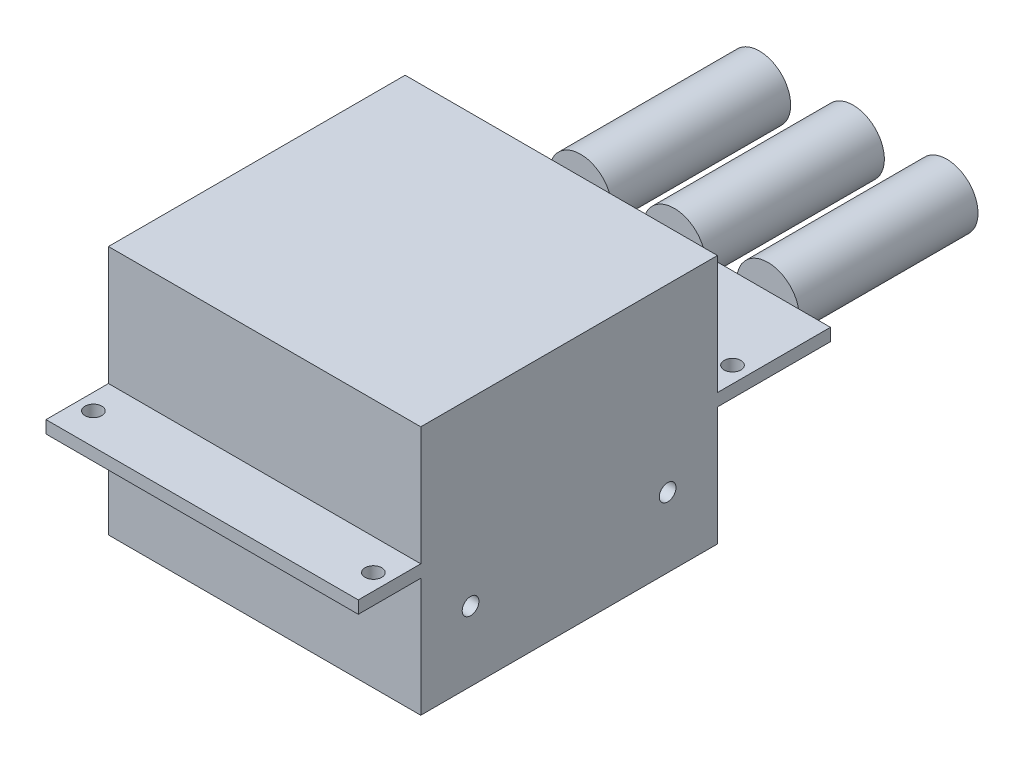
ISO-10303-21;
HEADER;
FILE_DESCRIPTION(('STEP AP214'),'2;1');
FILE_NAME('part.step','',(''),(''),'','','');
FILE_SCHEMA(('AUTOMOTIVE_DESIGN { 1 0 10303 214 1 1 1 1 }'));
ENDSEC;
DATA;
#1=APPLICATION_CONTEXT('core data for automotive mechanical design processes');
#2=APPLICATION_PROTOCOL_DEFINITION('international standard','automotive_design',2000,#1);
#3=PRODUCT_CONTEXT('',#1,'mechanical');
#4=PRODUCT('Part','Part','',(#3));
#5=PRODUCT_RELATED_PRODUCT_CATEGORY('part','',(#4));
#6=PRODUCT_DEFINITION_FORMATION('','',#4);
#7=PRODUCT_DEFINITION_CONTEXT('part definition',#1,'design');
#8=PRODUCT_DEFINITION('design','',#6,#7);
#9=PRODUCT_DEFINITION_SHAPE('','',#8);
#10=(LENGTH_UNIT() NAMED_UNIT(*) SI_UNIT(.MILLI.,.METRE.));
#11=(NAMED_UNIT(*) PLANE_ANGLE_UNIT() SI_UNIT($,.RADIAN.));
#12=(NAMED_UNIT(*) SI_UNIT($,.STERADIAN.) SOLID_ANGLE_UNIT());
#13=UNCERTAINTY_MEASURE_WITH_UNIT(LENGTH_MEASURE(1.E-05),#10,'distance_accuracy_value','');
#14=(GEOMETRIC_REPRESENTATION_CONTEXT(3) GLOBAL_UNCERTAINTY_ASSIGNED_CONTEXT((#13)) GLOBAL_UNIT_ASSIGNED_CONTEXT((#10,
#11,#12)) REPRESENTATION_CONTEXT('',''));
#15=CARTESIAN_POINT('',(0.,0.,0.));
#16=DIRECTION('',(0.,0.,1.));
#17=DIRECTION('',(1.,0.,0.));
#18=AXIS2_PLACEMENT_3D('',#15,#16,#17);
#19=CARTESIAN_POINT('',(-31.75,25.4,-96.));
#20=DIRECTION('',(-1.,0.,0.));
#21=DIRECTION('',(0.,0.,1.));
#22=AXIS2_PLACEMENT_3D('',#19,#20,#21);
#23=PLANE('',#22);
#24=CARTESIAN_POINT('',(-31.75,-11.225,-62.898125));
#25=DIRECTION('',(-1.,0.,0.));
#26=DIRECTION('',(0.,0.,1.));
#27=AXIS2_PLACEMENT_3D('',#24,#25,#26);
#28=CIRCLE('',#27,1.7);
#29=CARTESIAN_POINT('',(-31.75,-11.225,-61.198125));
#30=VERTEX_POINT('',#29);
#31=EDGE_CURVE('E332',#30,#30,#28,.T.);
#32=ORIENTED_EDGE('',*,*,#31,.F.);
#33=EDGE_LOOP('',(#32));
#34=FACE_BOUND('',#33,.T.);
#35=CARTESIAN_POINT('',(-31.75,-11.225,-22.826875));
#36=DIRECTION('',(1.,0.,0.));
#37=DIRECTION('',(0.,0.,-1.));
#38=AXIS2_PLACEMENT_3D('',#35,#36,#37);
#39=CIRCLE('',#38,1.7);
#40=CARTESIAN_POINT('',(-31.75,-11.225,-24.526875));
#41=VERTEX_POINT('',#40);
#42=EDGE_CURVE('E326',#41,#41,#39,.T.);
#43=ORIENTED_EDGE('',*,*,#42,.T.);
#44=EDGE_LOOP('',(#43));
#45=FACE_BOUND('',#44,.T.);
#46=DIRECTION('',(0.,1.,0.));
#47=VECTOR('',#46,1.);
#48=CARTESIAN_POINT('',(-31.75,25.4,-73.025));
#49=LINE('',#48,#47);
#50=CARTESIAN_POINT('',(-31.75,1.27,-73.025));
#51=VERTEX_POINT('',#50);
#52=CARTESIAN_POINT('',(-31.75,25.4,-73.025));
#53=VERTEX_POINT('',#52);
#54=EDGE_CURVE('E167',#51,#53,#49,.T.);
#55=ORIENTED_EDGE('',*,*,#54,.F.);
#56=DIRECTION('',(0.,0.,1.));
#57=VECTOR('',#56,1.);
#58=CARTESIAN_POINT('',(-31.75,1.26999999999999,-96.));
#59=LINE('',#58,#57);
#60=CARTESIAN_POINT('',(-31.75,1.26999999999999,-96.));
#61=VERTEX_POINT('',#60);
#62=EDGE_CURVE('E177',#61,#51,#59,.T.);
#63=ORIENTED_EDGE('',*,*,#62,.F.);
#64=DIRECTION('',(0.,-1.,0.));
#65=VECTOR('',#64,1.);
#66=CARTESIAN_POINT('',(-31.75,25.4,-96.));
#67=LINE('',#66,#65);
#68=CARTESIAN_POINT('',(-31.75,-1.27,-96.));
#69=VERTEX_POINT('',#68);
#70=EDGE_CURVE('E208',#61,#69,#67,.T.);
#71=ORIENTED_EDGE('',*,*,#70,.T.);
#72=DIRECTION('',(0.,0.,1.));
#73=VECTOR('',#72,1.);
#74=CARTESIAN_POINT('',(-31.75,-1.27,-96.));
#75=LINE('',#74,#73);
#76=CARTESIAN_POINT('',(-31.75,-1.27,-73.025));
#77=VERTEX_POINT('',#76);
#78=EDGE_CURVE('E271',#69,#77,#75,.T.);
#79=ORIENTED_EDGE('',*,*,#78,.T.);
#80=DIRECTION('',(0.,-1.,0.));
#81=VECTOR('',#80,1.);
#82=CARTESIAN_POINT('',(-31.75,-25.4,-73.025));
#83=LINE('',#82,#81);
#84=CARTESIAN_POINT('',(-31.75,-25.4,-73.025));
#85=VERTEX_POINT('',#84);
#86=EDGE_CURVE('E274',#77,#85,#83,.T.);
#87=ORIENTED_EDGE('',*,*,#86,.T.);
#88=DIRECTION('',(0.,0.,1.));
#89=VECTOR('',#88,1.);
#90=CARTESIAN_POINT('',(-31.75,-25.4,-96.));
#91=LINE('',#90,#89);
#92=CARTESIAN_POINT('',(-31.75,-25.4,-12.7));
#93=VERTEX_POINT('',#92);
#94=EDGE_CURVE('E42',#85,#93,#91,.T.);
#95=ORIENTED_EDGE('',*,*,#94,.T.);
#96=DIRECTION('',(0.,1.,0.));
#97=VECTOR('',#96,1.);
#98=CARTESIAN_POINT('',(-31.75,-25.4,-12.7));
#99=LINE('',#98,#97);
#100=CARTESIAN_POINT('',(-31.75,-1.27,-12.7));
#101=VERTEX_POINT('',#100);
#102=EDGE_CURVE('E244',#93,#101,#99,.T.);
#103=ORIENTED_EDGE('',*,*,#102,.T.);
#104=DIRECTION('',(0.,0.,1.));
#105=VECTOR('',#104,1.);
#106=CARTESIAN_POINT('',(-31.75,-1.27,0.));
#107=LINE('',#106,#105);
#108=CARTESIAN_POINT('',(-31.75,-1.27,0.));
#109=VERTEX_POINT('',#108);
#110=EDGE_CURVE('E247',#101,#109,#107,.T.);
#111=ORIENTED_EDGE('',*,*,#110,.T.);
#112=DIRECTION('',(0.,-1.,0.));
#113=VECTOR('',#112,1.);
#114=CARTESIAN_POINT('',(-31.75,25.4,0.));
#115=LINE('',#114,#113);
#116=CARTESIAN_POINT('',(-31.75,1.26999999999999,0.));
#117=VERTEX_POINT('',#116);
#118=EDGE_CURVE('E215',#117,#109,#115,.T.);
#119=ORIENTED_EDGE('',*,*,#118,.F.);
#120=DIRECTION('',(0.,0.,1.));
#121=VECTOR('',#120,1.);
#122=CARTESIAN_POINT('',(-31.75,1.26999999999999,0.));
#123=LINE('',#122,#121);
#124=CARTESIAN_POINT('',(-31.75,1.26999999999999,-12.7));
#125=VERTEX_POINT('',#124);
#126=EDGE_CURVE('E56',#125,#117,#123,.T.);
#127=ORIENTED_EDGE('',*,*,#126,.F.);
#128=DIRECTION('',(0.,-1.,0.));
#129=VECTOR('',#128,1.);
#130=CARTESIAN_POINT('',(-31.75,25.4,-12.7));
#131=LINE('',#130,#129);
#132=CARTESIAN_POINT('',(-31.75,25.4,-12.7));
#133=VERTEX_POINT('',#132);
#134=EDGE_CURVE('E190',#133,#125,#131,.T.);
#135=ORIENTED_EDGE('',*,*,#134,.F.);
#136=DIRECTION('',(0.,0.,1.));
#137=VECTOR('',#136,1.);
#138=CARTESIAN_POINT('',(-31.75,25.4,-96.));
#139=LINE('',#138,#137);
#140=EDGE_CURVE('E185',#53,#133,#139,.T.);
#141=ORIENTED_EDGE('',*,*,#140,.F.);
#142=EDGE_LOOP('',(#55,#63,#71,#79,#87,#95,#103,#111,#119,#127,#135,#141));
#143=FACE_BOUND('',#142,.T.);
#144=ADVANCED_FACE('F39',(#34,#45,#143),#23,.T.);
#145=CARTESIAN_POINT('',(31.75,25.4,-96.));
#146=DIRECTION('',(0.,1.,0.));
#147=DIRECTION('',(-1.,0.,0.));
#148=AXIS2_PLACEMENT_3D('',#145,#146,#147);
#149=PLANE('',#148);
#150=DIRECTION('',(0.,0.,1.));
#151=VECTOR('',#150,1.);
#152=CARTESIAN_POINT('',(31.75,25.4,-96.));
#153=LINE('',#152,#151);
#154=CARTESIAN_POINT('',(31.75,25.4,-73.025));
#155=VERTEX_POINT('',#154);
#156=CARTESIAN_POINT('',(31.75,25.4,-12.7));
#157=VERTEX_POINT('',#156);
#158=EDGE_CURVE('E187',#155,#157,#153,.T.);
#159=ORIENTED_EDGE('',*,*,#158,.F.);
#160=DIRECTION('',(1.,0.,0.));
#161=VECTOR('',#160,1.);
#162=CARTESIAN_POINT('',(-31.75,25.4,-73.025));
#163=LINE('',#162,#161);
#164=EDGE_CURVE('E171',#53,#155,#163,.T.);
#165=ORIENTED_EDGE('',*,*,#164,.F.);
#166=ORIENTED_EDGE('',*,*,#140,.T.);
#167=DIRECTION('',(1.,0.,0.));
#168=VECTOR('',#167,1.);
#169=CARTESIAN_POINT('',(-31.75,25.4,-12.7));
#170=LINE('',#169,#168);
#171=EDGE_CURVE('E286',#133,#157,#170,.T.);
#172=ORIENTED_EDGE('',*,*,#171,.T.);
#173=EDGE_LOOP('',(#159,#165,#166,#172));
#174=FACE_BOUND('',#173,.T.);
#175=ADVANCED_FACE('F183',(#174),#149,.T.);
#176=CARTESIAN_POINT('',(31.75,25.4,-96.));
#177=DIRECTION('',(1.,0.,0.));
#178=DIRECTION('',(0.,0.,-1.));
#179=AXIS2_PLACEMENT_3D('',#176,#177,#178);
#180=PLANE('',#179);
#181=CARTESIAN_POINT('',(31.75,-11.225,-62.898125));
#182=DIRECTION('',(-1.,0.,0.));
#183=DIRECTION('',(0.,0.,1.));
#184=AXIS2_PLACEMENT_3D('',#181,#182,#183);
#185=CIRCLE('',#184,1.7);
#186=CARTESIAN_POINT('',(31.75,-11.225,-61.198125));
#187=VERTEX_POINT('',#186);
#188=EDGE_CURVE('E335',#187,#187,#185,.T.);
#189=ORIENTED_EDGE('',*,*,#188,.T.);
#190=EDGE_LOOP('',(#189));
#191=FACE_BOUND('',#190,.T.);
#192=CARTESIAN_POINT('',(31.75,-11.225,-22.826875));
#193=DIRECTION('',(1.,0.,0.));
#194=DIRECTION('',(0.,0.,-1.));
#195=AXIS2_PLACEMENT_3D('',#192,#193,#194);
#196=CIRCLE('',#195,1.7);
#197=CARTESIAN_POINT('',(31.75,-11.225,-24.526875));
#198=VERTEX_POINT('',#197);
#199=EDGE_CURVE('E329',#198,#198,#196,.T.);
#200=ORIENTED_EDGE('',*,*,#199,.F.);
#201=EDGE_LOOP('',(#200));
#202=FACE_BOUND('',#201,.T.);
#203=DIRECTION('',(0.,1.,0.));
#204=VECTOR('',#203,1.);
#205=CARTESIAN_POINT('',(31.75,25.4,-96.));
#206=LINE('',#205,#204);
#207=CARTESIAN_POINT('',(31.75,-1.27,-96.));
#208=VERTEX_POINT('',#207);
#209=CARTESIAN_POINT('',(31.75,1.27000000000001,-96.));
#210=VERTEX_POINT('',#209);
#211=EDGE_CURVE('E203',#208,#210,#206,.T.);
#212=ORIENTED_EDGE('',*,*,#211,.T.);
#213=DIRECTION('',(0.,0.,1.));
#214=VECTOR('',#213,1.);
#215=CARTESIAN_POINT('',(31.75,1.27000000000001,-96.));
#216=LINE('',#215,#214);
#217=CARTESIAN_POINT('',(31.75,1.27000000000001,-73.025));
#218=VERTEX_POINT('',#217);
#219=EDGE_CURVE('E178',#210,#218,#216,.T.);
#220=ORIENTED_EDGE('',*,*,#219,.T.);
#221=DIRECTION('',(0.,1.,0.));
#222=VECTOR('',#221,1.);
#223=CARTESIAN_POINT('',(31.75,25.4,-73.025));
#224=LINE('',#223,#222);
#225=EDGE_CURVE('E288',#218,#155,#224,.T.);
#226=ORIENTED_EDGE('',*,*,#225,.T.);
#227=ORIENTED_EDGE('',*,*,#158,.T.);
#228=DIRECTION('',(0.,-1.,0.));
#229=VECTOR('',#228,1.);
#230=CARTESIAN_POINT('',(31.75,25.4,-12.7));
#231=LINE('',#230,#229);
#232=CARTESIAN_POINT('',(31.75,1.27000000000001,-12.7));
#233=VERTEX_POINT('',#232);
#234=EDGE_CURVE('E289',#157,#233,#231,.T.);
#235=ORIENTED_EDGE('',*,*,#234,.T.);
#236=DIRECTION('',(0.,0.,1.));
#237=VECTOR('',#236,1.);
#238=CARTESIAN_POINT('',(31.75,1.27000000000001,0.));
#239=LINE('',#238,#237);
#240=CARTESIAN_POINT('',(31.75,1.27000000000001,0.));
#241=VERTEX_POINT('',#240);
#242=EDGE_CURVE('E292',#233,#241,#239,.T.);
#243=ORIENTED_EDGE('',*,*,#242,.T.);
#244=DIRECTION('',(0.,1.,0.));
#245=VECTOR('',#244,1.);
#246=CARTESIAN_POINT('',(31.75,25.4,0.));
#247=LINE('',#246,#245);
#248=CARTESIAN_POINT('',(31.75,-1.27,0.));
#249=VERTEX_POINT('',#248);
#250=EDGE_CURVE('E195',#249,#241,#247,.T.);
#251=ORIENTED_EDGE('',*,*,#250,.F.);
#252=DIRECTION('',(0.,0.,1.));
#253=VECTOR('',#252,1.);
#254=CARTESIAN_POINT('',(31.75,-1.27,0.));
#255=LINE('',#254,#253);
#256=CARTESIAN_POINT('',(31.75,-1.27,-12.7));
#257=VERTEX_POINT('',#256);
#258=EDGE_CURVE('E246',#257,#249,#255,.T.);
#259=ORIENTED_EDGE('',*,*,#258,.F.);
#260=DIRECTION('',(0.,1.,0.));
#261=VECTOR('',#260,1.);
#262=CARTESIAN_POINT('',(31.75,-25.4,-12.7));
#263=LINE('',#262,#261);
#264=CARTESIAN_POINT('',(31.75,-25.4,-12.7));
#265=VERTEX_POINT('',#264);
#266=EDGE_CURVE('E251',#265,#257,#263,.T.);
#267=ORIENTED_EDGE('',*,*,#266,.F.);
#268=DIRECTION('',(0.,0.,1.));
#269=VECTOR('',#268,1.);
#270=CARTESIAN_POINT('',(31.75,-25.4,-96.));
#271=LINE('',#270,#269);
#272=CARTESIAN_POINT('',(31.75,-25.4,-73.025));
#273=VERTEX_POINT('',#272);
#274=EDGE_CURVE('E192',#273,#265,#271,.T.);
#275=ORIENTED_EDGE('',*,*,#274,.F.);
#276=DIRECTION('',(0.,-1.,0.));
#277=VECTOR('',#276,1.);
#278=CARTESIAN_POINT('',(31.75,-25.4,-73.025));
#279=LINE('',#278,#277);
#280=CARTESIAN_POINT('',(31.75,-1.27,-73.025));
#281=VERTEX_POINT('',#280);
#282=EDGE_CURVE('E269',#281,#273,#279,.T.);
#283=ORIENTED_EDGE('',*,*,#282,.F.);
#284=DIRECTION('',(0.,0.,1.));
#285=VECTOR('',#284,1.);
#286=CARTESIAN_POINT('',(31.75,-1.27,-96.));
#287=LINE('',#286,#285);
#288=EDGE_CURVE('E254',#208,#281,#287,.T.);
#289=ORIENTED_EDGE('',*,*,#288,.F.);
#290=EDGE_LOOP('',(#212,#220,#226,#227,#235,#243,#251,#259,#267,#275,#283,#289));
#291=FACE_BOUND('',#290,.T.);
#292=ADVANCED_FACE('F355',(#191,#202,#291),#180,.T.);
#293=CARTESIAN_POINT('',(0.,0.,-96.));
#294=DIRECTION('',(0.,0.,-1.));
#295=DIRECTION('',(-1.,0.,0.));
#296=AXIS2_PLACEMENT_3D('',#293,#294,#295);
#297=PLANE('',#296);
#298=ORIENTED_EDGE('',*,*,#70,.F.);
#299=DIRECTION('',(1.,0.,0.));
#300=VECTOR('',#299,1.);
#301=CARTESIAN_POINT('',(-31.75,1.26999999999999,-96.));
#302=LINE('',#301,#300);
#303=CARTESIAN_POINT('',(-25.2717039466693,1.26999999999999,-96.));
#304=VERTEX_POINT('',#303);
#305=EDGE_CURVE('E281',#61,#304,#302,.T.);
#306=ORIENTED_EDGE('',*,*,#305,.T.);
#307=CARTESIAN_POINT('',(-19.05,0.,-96.));
#308=DIRECTION('',(0.,0.,-1.));
#309=DIRECTION('',(-1.,0.,0.));
#310=AXIS2_PLACEMENT_3D('',#307,#308,#309);
#311=CIRCLE('',#310,6.35);
#312=CARTESIAN_POINT('',(-25.2717039466693,-1.27,-96.));
#313=VERTEX_POINT('',#312);
#314=EDGE_CURVE('E243',#313,#304,#311,.T.);
#315=ORIENTED_EDGE('',*,*,#314,.F.);
#316=DIRECTION('',(1.,0.,0.));
#317=VECTOR('',#316,1.);
#318=CARTESIAN_POINT('',(-31.75,-1.27,-96.));
#319=LINE('',#318,#317);
#320=EDGE_CURVE('E262',#69,#313,#319,.T.);
#321=ORIENTED_EDGE('',*,*,#320,.F.);
#322=EDGE_LOOP('',(#298,#306,#315,#321));
#323=FACE_BOUND('',#322,.T.);
#324=ADVANCED_FACE('F357',(#323),#297,.T.);
#325=CARTESIAN_POINT('',(-12.8282960533307,1.27,-96.));
#326=VERTEX_POINT('',#325);
#327=CARTESIAN_POINT('',(-12.8282960533307,-1.27,-96.));
#328=VERTEX_POINT('',#327);
#329=EDGE_CURVE('E239',#326,#328,#311,.T.);
#330=ORIENTED_EDGE('',*,*,#329,.F.);
#331=CARTESIAN_POINT('',(-6.22170394666927,1.27,-96.));
#332=VERTEX_POINT('',#331);
#333=EDGE_CURVE('E415',#326,#332,#302,.T.);
#334=ORIENTED_EDGE('',*,*,#333,.T.);
#335=CARTESIAN_POINT('',(0.,0.,-96.));
#336=DIRECTION('',(0.,0.,-1.));
#337=DIRECTION('',(-1.,0.,0.));
#338=AXIS2_PLACEMENT_3D('',#335,#336,#337);
#339=CIRCLE('',#338,6.35);
#340=CARTESIAN_POINT('',(-6.22170394666927,-1.27,-96.));
#341=VERTEX_POINT('',#340);
#342=EDGE_CURVE('E47',#341,#332,#339,.T.);
#343=ORIENTED_EDGE('',*,*,#342,.F.);
#344=EDGE_CURVE('E440',#328,#341,#319,.T.);
#345=ORIENTED_EDGE('',*,*,#344,.F.);
#346=EDGE_LOOP('',(#330,#334,#343,#345));
#347=FACE_BOUND('',#346,.T.);
#348=ADVANCED_FACE('F364',(#347),#297,.T.);
#349=CARTESIAN_POINT('',(6.22170394666927,1.27,-96.));
#350=VERTEX_POINT('',#349);
#351=CARTESIAN_POINT('',(6.22170394666927,-1.27,-96.));
#352=VERTEX_POINT('',#351);
#353=EDGE_CURVE('E49',#350,#352,#339,.T.);
#354=ORIENTED_EDGE('',*,*,#353,.F.);
#355=CARTESIAN_POINT('',(12.8282960533307,1.27,-96.));
#356=VERTEX_POINT('',#355);
#357=EDGE_CURVE('E406',#350,#356,#302,.T.);
#358=ORIENTED_EDGE('',*,*,#357,.T.);
#359=CARTESIAN_POINT('',(19.05,0.,-96.));
#360=DIRECTION('',(0.,0.,-1.));
#361=DIRECTION('',(-1.,0.,0.));
#362=AXIS2_PLACEMENT_3D('',#359,#360,#361);
#363=CIRCLE('',#362,6.35);
#364=CARTESIAN_POINT('',(12.8282960533307,-1.27,-96.));
#365=VERTEX_POINT('',#364);
#366=EDGE_CURVE('E228',#365,#356,#363,.T.);
#367=ORIENTED_EDGE('',*,*,#366,.F.);
#368=EDGE_CURVE('E438',#352,#365,#319,.T.);
#369=ORIENTED_EDGE('',*,*,#368,.F.);
#370=EDGE_LOOP('',(#354,#358,#367,#369));
#371=FACE_BOUND('',#370,.T.);
#372=ADVANCED_FACE('F441',(#371),#297,.T.);
#373=CARTESIAN_POINT('',(25.2717039466693,1.27000000000001,-96.));
#374=VERTEX_POINT('',#373);
#375=CARTESIAN_POINT('',(25.2717039466693,-1.27,-96.));
#376=VERTEX_POINT('',#375);
#377=EDGE_CURVE('E230',#374,#376,#363,.T.);
#378=ORIENTED_EDGE('',*,*,#377,.F.);
#379=EDGE_CURVE('E299',#374,#210,#302,.T.);
#380=ORIENTED_EDGE('',*,*,#379,.T.);
#381=ORIENTED_EDGE('',*,*,#211,.F.);
#382=EDGE_CURVE('E266',#376,#208,#319,.T.);
#383=ORIENTED_EDGE('',*,*,#382,.F.);
#384=EDGE_LOOP('',(#378,#380,#381,#383));
#385=FACE_BOUND('',#384,.T.);
#386=ADVANCED_FACE('F367',(#385),#297,.T.);
#387=CARTESIAN_POINT('',(0.,0.,0.));
#388=DIRECTION('',(0.,0.,-1.));
#389=DIRECTION('',(-1.,0.,0.));
#390=AXIS2_PLACEMENT_3D('',#387,#388,#389);
#391=PLANE('',#390);
#392=DIRECTION('',(1.,0.,0.));
#393=VECTOR('',#392,1.);
#394=CARTESIAN_POINT('',(-31.75,1.26999999999999,0.));
#395=LINE('',#394,#393);
#396=EDGE_CURVE('E282',#117,#241,#395,.T.);
#397=ORIENTED_EDGE('',*,*,#396,.F.);
#398=ORIENTED_EDGE('',*,*,#118,.T.);
#399=DIRECTION('',(1.,0.,0.));
#400=VECTOR('',#399,1.);
#401=CARTESIAN_POINT('',(-31.75,-1.27,0.));
#402=LINE('',#401,#400);
#403=EDGE_CURVE('E256',#109,#249,#402,.T.);
#404=ORIENTED_EDGE('',*,*,#403,.T.);
#405=ORIENTED_EDGE('',*,*,#250,.T.);
#406=EDGE_LOOP('',(#397,#398,#404,#405));
#407=FACE_BOUND('',#406,.T.);
#408=ADVANCED_FACE('F373',(#407),#391,.F.);
#409=CARTESIAN_POINT('',(31.75,-25.4,-96.));
#410=DIRECTION('',(0.,-1.,0.));
#411=DIRECTION('',(1.,0.,0.));
#412=AXIS2_PLACEMENT_3D('',#409,#410,#411);
#413=PLANE('',#412);
#414=DIRECTION('',(1.,0.,0.));
#415=VECTOR('',#414,1.);
#416=CARTESIAN_POINT('',(-31.75,-25.4,-73.025));
#417=LINE('',#416,#415);
#418=EDGE_CURVE('E240',#85,#273,#417,.T.);
#419=ORIENTED_EDGE('',*,*,#418,.T.);
#420=ORIENTED_EDGE('',*,*,#274,.T.);
#421=DIRECTION('',(1.,0.,0.));
#422=VECTOR('',#421,1.);
#423=CARTESIAN_POINT('',(-31.75,-25.4,-12.7));
#424=LINE('',#423,#422);
#425=EDGE_CURVE('E250',#93,#265,#424,.T.);
#426=ORIENTED_EDGE('',*,*,#425,.F.);
#427=ORIENTED_EDGE('',*,*,#94,.F.);
#428=EDGE_LOOP('',(#419,#420,#426,#427));
#429=FACE_BOUND('',#428,.T.);
#430=ADVANCED_FACE('F370',(#429),#413,.T.);
#431=CARTESIAN_POINT('',(0.,0.,-132.36));
#432=DIRECTION('',(0.,0.,1.));
#433=DIRECTION('',(1.,0.,0.));
#434=AXIS2_PLACEMENT_3D('',#431,#432,#433);
#435=CYLINDRICAL_SURFACE('',#434,6.35);
#436=CARTESIAN_POINT('',(0.,0.,-132.36));
#437=DIRECTION('',(0.,0.,-1.));
#438=DIRECTION('',(-1.,0.,0.));
#439=AXIS2_PLACEMENT_3D('',#436,#437,#438);
#440=CIRCLE('',#439,6.35);
#441=CARTESIAN_POINT('',(-6.35,0.,-132.36));
#442=VERTEX_POINT('',#441);
#443=EDGE_CURVE('E216',#442,#442,#440,.T.);
#444=ORIENTED_EDGE('',*,*,#443,.F.);
#445=EDGE_LOOP('',(#444));
#446=FACE_BOUND('',#445,.T.);
#447=EDGE_CURVE('E11',#352,#341,#339,.T.);
#448=ORIENTED_EDGE('',*,*,#447,.T.);
#449=ORIENTED_EDGE('',*,*,#342,.T.);
#450=CARTESIAN_POINT('',(0.,0.,-96.));
#451=DIRECTION('',(0.,0.,1.));
#452=DIRECTION('',(1.,0.,0.));
#453=AXIS2_PLACEMENT_3D('',#450,#451,#452);
#454=CIRCLE('',#453,6.35);
#455=EDGE_CURVE('E259',#350,#332,#454,.T.);
#456=ORIENTED_EDGE('',*,*,#455,.F.);
#457=ORIENTED_EDGE('',*,*,#353,.T.);
#458=EDGE_LOOP('',(#448,#449,#456,#457));
#459=FACE_BOUND('',#458,.T.);
#460=ADVANCED_FACE('F372',(#446,#459),#435,.T.);
#461=CARTESIAN_POINT('',(0.,0.,-132.36));
#462=DIRECTION('',(0.,0.,-1.));
#463=DIRECTION('',(-1.,0.,0.));
#464=AXIS2_PLACEMENT_3D('',#461,#462,#463);
#465=PLANE('',#464);
#466=ORIENTED_EDGE('',*,*,#443,.T.);
#467=EDGE_LOOP('',(#466));
#468=FACE_BOUND('',#467,.T.);
#469=ADVANCED_FACE('F378',(#468),#465,.T.);
#470=CARTESIAN_POINT('',(19.05,0.,-132.36));
#471=DIRECTION('',(0.,0.,1.));
#472=DIRECTION('',(1.,0.,0.));
#473=AXIS2_PLACEMENT_3D('',#470,#471,#472);
#474=CYLINDRICAL_SURFACE('',#473,6.35);
#475=CARTESIAN_POINT('',(19.05,0.,-132.36));
#476=DIRECTION('',(0.,0.,-1.));
#477=DIRECTION('',(-1.,0.,0.));
#478=AXIS2_PLACEMENT_3D('',#475,#476,#477);
#479=CIRCLE('',#478,6.35);
#480=CARTESIAN_POINT('',(12.7,0.,-132.36));
#481=VERTEX_POINT('',#480);
#482=EDGE_CURVE('E232',#481,#481,#479,.T.);
#483=ORIENTED_EDGE('',*,*,#482,.F.);
#484=EDGE_LOOP('',(#483));
#485=FACE_BOUND('',#484,.T.);
#486=EDGE_CURVE('E223',#376,#365,#363,.T.);
#487=ORIENTED_EDGE('',*,*,#486,.T.);
#488=ORIENTED_EDGE('',*,*,#366,.T.);
#489=CARTESIAN_POINT('',(19.05,0.,-96.));
#490=DIRECTION('',(0.,0.,1.));
#491=DIRECTION('',(1.,0.,0.));
#492=AXIS2_PLACEMENT_3D('',#489,#490,#491);
#493=CIRCLE('',#492,6.35);
#494=EDGE_CURVE('E279',#374,#356,#493,.T.);
#495=ORIENTED_EDGE('',*,*,#494,.F.);
#496=ORIENTED_EDGE('',*,*,#377,.T.);
#497=EDGE_LOOP('',(#487,#488,#495,#496));
#498=FACE_BOUND('',#497,.T.);
#499=ADVANCED_FACE('F490',(#485,#498),#474,.T.);
#500=CARTESIAN_POINT('',(19.05,0.,-132.36));
#501=DIRECTION('',(0.,0.,-1.));
#502=DIRECTION('',(-1.,0.,0.));
#503=AXIS2_PLACEMENT_3D('',#500,#501,#502);
#504=PLANE('',#503);
#505=ORIENTED_EDGE('',*,*,#482,.T.);
#506=EDGE_LOOP('',(#505));
#507=FACE_BOUND('',#506,.T.);
#508=ADVANCED_FACE('F485',(#507),#504,.T.);
#509=CARTESIAN_POINT('',(-19.05,0.,-132.36));
#510=DIRECTION('',(0.,0.,1.));
#511=DIRECTION('',(1.,0.,0.));
#512=AXIS2_PLACEMENT_3D('',#509,#510,#511);
#513=CYLINDRICAL_SURFACE('',#512,6.35);
#514=CARTESIAN_POINT('',(-19.05,0.,-132.36));
#515=DIRECTION('',(0.,0.,-1.));
#516=DIRECTION('',(-1.,0.,0.));
#517=AXIS2_PLACEMENT_3D('',#514,#515,#516);
#518=CIRCLE('',#517,6.35);
#519=CARTESIAN_POINT('',(-25.4,0.,-132.36));
#520=VERTEX_POINT('',#519);
#521=EDGE_CURVE('E236',#520,#520,#518,.T.);
#522=ORIENTED_EDGE('',*,*,#521,.F.);
#523=EDGE_LOOP('',(#522));
#524=FACE_BOUND('',#523,.T.);
#525=EDGE_CURVE('E234',#328,#313,#311,.T.);
#526=ORIENTED_EDGE('',*,*,#525,.T.);
#527=ORIENTED_EDGE('',*,*,#314,.T.);
#528=EDGE_CURVE('E455',#304,#326,#311,.T.);
#529=ORIENTED_EDGE('',*,*,#528,.T.);
#530=ORIENTED_EDGE('',*,*,#329,.T.);
#531=EDGE_LOOP('',(#526,#527,#529,#530));
#532=FACE_BOUND('',#531,.T.);
#533=ADVANCED_FACE('F454',(#524,#532),#513,.T.);
#534=CARTESIAN_POINT('',(-19.05,0.,-132.36));
#535=DIRECTION('',(0.,0.,-1.));
#536=DIRECTION('',(-1.,0.,0.));
#537=AXIS2_PLACEMENT_3D('',#534,#535,#536);
#538=PLANE('',#537);
#539=ORIENTED_EDGE('',*,*,#521,.T.);
#540=EDGE_LOOP('',(#539));
#541=FACE_BOUND('',#540,.T.);
#542=ADVANCED_FACE('F484',(#541),#538,.T.);
#543=CARTESIAN_POINT('',(-31.75,-25.4,-96.));
#544=DIRECTION('',(0.,0.,-1.));
#545=DIRECTION('',(-1.,0.,0.));
#546=AXIS2_PLACEMENT_3D('',#543,#544,#545);
#547=PLANE('',#546);
#548=EDGE_CURVE('E431',#341,#352,#319,.T.);
#549=ORIENTED_EDGE('',*,*,#548,.F.);
#550=ORIENTED_EDGE('',*,*,#447,.F.);
#551=EDGE_LOOP('',(#549,#550));
#552=FACE_BOUND('',#551,.T.);
#553=ADVANCED_FACE('F430',(#552),#547,.F.);
#554=EDGE_CURVE('E442',#365,#376,#319,.T.);
#555=ORIENTED_EDGE('',*,*,#554,.F.);
#556=ORIENTED_EDGE('',*,*,#486,.F.);
#557=EDGE_LOOP('',(#555,#556));
#558=FACE_BOUND('',#557,.T.);
#559=ADVANCED_FACE('F524',(#558),#547,.F.);
#560=EDGE_CURVE('E265',#313,#328,#319,.T.);
#561=ORIENTED_EDGE('',*,*,#560,.F.);
#562=ORIENTED_EDGE('',*,*,#525,.F.);
#563=EDGE_LOOP('',(#561,#562));
#564=FACE_BOUND('',#563,.T.);
#565=ADVANCED_FACE('F452',(#564),#547,.F.);
#566=CARTESIAN_POINT('',(-31.75,-25.4,-73.025));
#567=DIRECTION('',(0.,0.,1.));
#568=DIRECTION('',(1.,0.,0.));
#569=AXIS2_PLACEMENT_3D('',#566,#567,#568);
#570=PLANE('',#569);
#571=ORIENTED_EDGE('',*,*,#282,.T.);
#572=ORIENTED_EDGE('',*,*,#418,.F.);
#573=ORIENTED_EDGE('',*,*,#86,.F.);
#574=DIRECTION('',(1.,0.,0.));
#575=VECTOR('',#574,1.);
#576=CARTESIAN_POINT('',(-31.75,-1.27,-73.025));
#577=LINE('',#576,#575);
#578=EDGE_CURVE('E264',#77,#281,#577,.T.);
#579=ORIENTED_EDGE('',*,*,#578,.T.);
#580=EDGE_LOOP('',(#571,#572,#573,#579));
#581=FACE_BOUND('',#580,.T.);
#582=ADVANCED_FACE('F445',(#581),#570,.F.);
#583=CARTESIAN_POINT('',(-31.75,-1.27,-96.));
#584=DIRECTION('',(0.,1.,0.));
#585=DIRECTION('',(0.,0.,1.));
#586=AXIS2_PLACEMENT_3D('',#583,#584,#585);
#587=PLANE('',#586);
#588=CARTESIAN_POINT('',(28.4625,-1.27000000000001,-79.375));
#589=DIRECTION('',(0.,-1.,0.));
#590=DIRECTION('',(1.,0.,0.));
#591=AXIS2_PLACEMENT_3D('',#588,#589,#590);
#592=CIRCLE('',#591,1.7);
#593=CARTESIAN_POINT('',(30.1625,-1.27000000000001,-79.375));
#594=VERTEX_POINT('',#593);
#595=EDGE_CURVE('E308',#594,#594,#592,.T.);
#596=ORIENTED_EDGE('',*,*,#595,.F.);
#597=EDGE_LOOP('',(#596));
#598=FACE_BOUND('',#597,.T.);
#599=CARTESIAN_POINT('',(-28.4625,-1.27000000000001,-79.375));
#600=DIRECTION('',(0.,1.,0.));
#601=DIRECTION('',(-1.,0.,0.));
#602=AXIS2_PLACEMENT_3D('',#599,#600,#601);
#603=CIRCLE('',#602,1.7);
#604=CARTESIAN_POINT('',(-30.1625,-1.27000000000001,-79.375));
#605=VERTEX_POINT('',#604);
#606=EDGE_CURVE('E295',#605,#605,#603,.T.);
#607=ORIENTED_EDGE('',*,*,#606,.T.);
#608=EDGE_LOOP('',(#607));
#609=FACE_BOUND('',#608,.T.);
#610=ORIENTED_EDGE('',*,*,#288,.T.);
#611=ORIENTED_EDGE('',*,*,#578,.F.);
#612=ORIENTED_EDGE('',*,*,#78,.F.);
#613=ORIENTED_EDGE('',*,*,#320,.T.);
#614=ORIENTED_EDGE('',*,*,#560,.T.);
#615=ORIENTED_EDGE('',*,*,#344,.T.);
#616=ORIENTED_EDGE('',*,*,#548,.T.);
#617=ORIENTED_EDGE('',*,*,#368,.T.);
#618=ORIENTED_EDGE('',*,*,#554,.T.);
#619=ORIENTED_EDGE('',*,*,#382,.T.);
#620=EDGE_LOOP('',(#610,#611,#612,#613,#614,#615,#616,#617,#618,#619));
#621=FACE_BOUND('',#620,.T.);
#622=ADVANCED_FACE('F436',(#598,#609,#621),#587,.F.);
#623=CARTESIAN_POINT('',(-31.75,-1.27,0.));
#624=DIRECTION('',(0.,1.,0.));
#625=DIRECTION('',(0.,0.,1.));
#626=AXIS2_PLACEMENT_3D('',#623,#624,#625);
#627=PLANE('',#626);
#628=CARTESIAN_POINT('',(-28.4625,-1.27000000000001,-6.35000000000001));
#629=DIRECTION('',(0.,-1.,0.));
#630=DIRECTION('',(-1.,0.,0.));
#631=AXIS2_PLACEMENT_3D('',#628,#629,#630);
#632=CIRCLE('',#631,1.7);
#633=CARTESIAN_POINT('',(-30.1625,-1.27000000000001,-6.35000000000001));
#634=VERTEX_POINT('',#633);
#635=EDGE_CURVE('E320',#634,#634,#632,.T.);
#636=ORIENTED_EDGE('',*,*,#635,.F.);
#637=EDGE_LOOP('',(#636));
#638=FACE_BOUND('',#637,.T.);
#639=CARTESIAN_POINT('',(28.4625,-1.27000000000001,-6.35000000000001));
#640=DIRECTION('',(0.,1.,0.));
#641=DIRECTION('',(1.,0.,0.));
#642=AXIS2_PLACEMENT_3D('',#639,#640,#641);
#643=CIRCLE('',#642,1.7);
#644=CARTESIAN_POINT('',(30.1625,-1.27000000000001,-6.35000000000001));
#645=VERTEX_POINT('',#644);
#646=EDGE_CURVE('E314',#645,#645,#643,.T.);
#647=ORIENTED_EDGE('',*,*,#646,.T.);
#648=EDGE_LOOP('',(#647));
#649=FACE_BOUND('',#648,.T.);
#650=ORIENTED_EDGE('',*,*,#258,.T.);
#651=ORIENTED_EDGE('',*,*,#403,.F.);
#652=ORIENTED_EDGE('',*,*,#110,.F.);
#653=DIRECTION('',(1.,0.,0.));
#654=VECTOR('',#653,1.);
#655=CARTESIAN_POINT('',(-31.75,-1.27,-12.7));
#656=LINE('',#655,#654);
#657=EDGE_CURVE('E258',#101,#257,#656,.T.);
#658=ORIENTED_EDGE('',*,*,#657,.T.);
#659=EDGE_LOOP('',(#650,#651,#652,#658));
#660=FACE_BOUND('',#659,.T.);
#661=ADVANCED_FACE('F391',(#638,#649,#660),#627,.F.);
#662=CARTESIAN_POINT('',(-31.75,-25.4,-12.7));
#663=DIRECTION('',(0.,0.,-1.));
#664=DIRECTION('',(-1.,0.,0.));
#665=AXIS2_PLACEMENT_3D('',#662,#663,#664);
#666=PLANE('',#665);
#667=ORIENTED_EDGE('',*,*,#266,.T.);
#668=ORIENTED_EDGE('',*,*,#657,.F.);
#669=ORIENTED_EDGE('',*,*,#102,.F.);
#670=ORIENTED_EDGE('',*,*,#425,.T.);
#671=EDGE_LOOP('',(#667,#668,#669,#670));
#672=FACE_BOUND('',#671,.T.);
#673=ADVANCED_FACE('F388',(#672),#666,.F.);
#674=CARTESIAN_POINT('',(-31.75,25.4,-96.));
#675=DIRECTION('',(0.,0.,1.));
#676=DIRECTION('',(1.,0.,0.));
#677=AXIS2_PLACEMENT_3D('',#674,#675,#676);
#678=PLANE('',#677);
#679=ORIENTED_EDGE('',*,*,#455,.T.);
#680=EDGE_CURVE('E409',#332,#350,#302,.T.);
#681=ORIENTED_EDGE('',*,*,#680,.T.);
#682=EDGE_LOOP('',(#679,#681));
#683=FACE_BOUND('',#682,.T.);
#684=ADVANCED_FACE('F460',(#683),#678,.T.);
#685=ORIENTED_EDGE('',*,*,#494,.T.);
#686=EDGE_CURVE('E405',#356,#374,#302,.T.);
#687=ORIENTED_EDGE('',*,*,#686,.T.);
#688=EDGE_LOOP('',(#685,#687));
#689=FACE_BOUND('',#688,.T.);
#690=ADVANCED_FACE('F458',(#689),#678,.T.);
#691=ORIENTED_EDGE('',*,*,#528,.F.);
#692=EDGE_CURVE('E63',#304,#326,#302,.T.);
#693=ORIENTED_EDGE('',*,*,#692,.T.);
#694=EDGE_LOOP('',(#691,#693));
#695=FACE_BOUND('',#694,.T.);
#696=ADVANCED_FACE('F456',(#695),#678,.T.);
#697=CARTESIAN_POINT('',(-31.75,1.26999999999999,-96.));
#698=DIRECTION('',(0.,1.,0.));
#699=DIRECTION('',(-1.,0.,0.));
#700=AXIS2_PLACEMENT_3D('',#697,#698,#699);
#701=PLANE('',#700);
#702=CARTESIAN_POINT('',(28.4625,1.26999999999999,-79.375));
#703=DIRECTION('',(0.,-1.,0.));
#704=DIRECTION('',(1.,0.,0.));
#705=AXIS2_PLACEMENT_3D('',#702,#703,#704);
#706=CIRCLE('',#705,1.7);
#707=CARTESIAN_POINT('',(30.1625,1.26999999999999,-79.375));
#708=VERTEX_POINT('',#707);
#709=EDGE_CURVE('E311',#708,#708,#706,.T.);
#710=ORIENTED_EDGE('',*,*,#709,.T.);
#711=EDGE_LOOP('',(#710));
#712=FACE_BOUND('',#711,.T.);
#713=CARTESIAN_POINT('',(-28.4625,1.26999999999999,-79.375));
#714=DIRECTION('',(0.,1.,0.));
#715=DIRECTION('',(-1.,0.,0.));
#716=AXIS2_PLACEMENT_3D('',#713,#714,#715);
#717=CIRCLE('',#716,1.7);
#718=CARTESIAN_POINT('',(-30.1625,1.26999999999999,-79.375));
#719=VERTEX_POINT('',#718);
#720=EDGE_CURVE('E305',#719,#719,#717,.T.);
#721=ORIENTED_EDGE('',*,*,#720,.F.);
#722=EDGE_LOOP('',(#721));
#723=FACE_BOUND('',#722,.T.);
#724=ORIENTED_EDGE('',*,*,#219,.F.);
#725=ORIENTED_EDGE('',*,*,#379,.F.);
#726=ORIENTED_EDGE('',*,*,#686,.F.);
#727=ORIENTED_EDGE('',*,*,#357,.F.);
#728=ORIENTED_EDGE('',*,*,#680,.F.);
#729=ORIENTED_EDGE('',*,*,#333,.F.);
#730=ORIENTED_EDGE('',*,*,#692,.F.);
#731=ORIENTED_EDGE('',*,*,#305,.F.);
#732=ORIENTED_EDGE('',*,*,#62,.T.);
#733=DIRECTION('',(1.,0.,0.));
#734=VECTOR('',#733,1.);
#735=CARTESIAN_POINT('',(-31.75,1.27,-73.025));
#736=LINE('',#735,#734);
#737=EDGE_CURVE('E173',#51,#218,#736,.T.);
#738=ORIENTED_EDGE('',*,*,#737,.T.);
#739=EDGE_LOOP('',(#724,#725,#726,#727,#728,#729,#730,#731,#732,#738));
#740=FACE_BOUND('',#739,.T.);
#741=ADVANCED_FACE('F398',(#712,#723,#740),#701,.T.);
#742=CARTESIAN_POINT('',(-31.75,25.4,-73.025));
#743=DIRECTION('',(0.,0.,-1.));
#744=DIRECTION('',(-1.,0.,0.));
#745=AXIS2_PLACEMENT_3D('',#742,#743,#744);
#746=PLANE('',#745);
#747=ORIENTED_EDGE('',*,*,#225,.F.);
#748=ORIENTED_EDGE('',*,*,#737,.F.);
#749=ORIENTED_EDGE('',*,*,#54,.T.);
#750=ORIENTED_EDGE('',*,*,#164,.T.);
#751=EDGE_LOOP('',(#747,#748,#749,#750));
#752=FACE_BOUND('',#751,.T.);
#753=ADVANCED_FACE('F170',(#752),#746,.T.);
#754=CARTESIAN_POINT('',(-31.75,25.4,-12.7));
#755=DIRECTION('',(0.,0.,1.));
#756=DIRECTION('',(1.,0.,0.));
#757=AXIS2_PLACEMENT_3D('',#754,#755,#756);
#758=PLANE('',#757);
#759=ORIENTED_EDGE('',*,*,#234,.F.);
#760=ORIENTED_EDGE('',*,*,#171,.F.);
#761=ORIENTED_EDGE('',*,*,#134,.T.);
#762=DIRECTION('',(1.,0.,0.));
#763=VECTOR('',#762,1.);
#764=CARTESIAN_POINT('',(-31.75,1.26999999999999,-12.7));
#765=LINE('',#764,#763);
#766=EDGE_CURVE('E284',#125,#233,#765,.T.);
#767=ORIENTED_EDGE('',*,*,#766,.T.);
#768=EDGE_LOOP('',(#759,#760,#761,#767));
#769=FACE_BOUND('',#768,.T.);
#770=ADVANCED_FACE('F395',(#769),#758,.T.);
#771=CARTESIAN_POINT('',(-31.75,1.26999999999999,0.));
#772=DIRECTION('',(0.,1.,0.));
#773=DIRECTION('',(-1.,0.,0.));
#774=AXIS2_PLACEMENT_3D('',#771,#772,#773);
#775=PLANE('',#774);
#776=CARTESIAN_POINT('',(-28.4625,1.26999999999999,-6.35000000000001));
#777=DIRECTION('',(0.,-1.,0.));
#778=DIRECTION('',(-1.,0.,0.));
#779=AXIS2_PLACEMENT_3D('',#776,#777,#778);
#780=CIRCLE('',#779,1.7);
#781=CARTESIAN_POINT('',(-30.1625,1.26999999999999,-6.35000000000001));
#782=VERTEX_POINT('',#781);
#783=EDGE_CURVE('E323',#782,#782,#780,.T.);
#784=ORIENTED_EDGE('',*,*,#783,.T.);
#785=EDGE_LOOP('',(#784));
#786=FACE_BOUND('',#785,.T.);
#787=CARTESIAN_POINT('',(28.4625,1.26999999999999,-6.35000000000001));
#788=DIRECTION('',(0.,1.,0.));
#789=DIRECTION('',(1.,0.,0.));
#790=AXIS2_PLACEMENT_3D('',#787,#788,#789);
#791=CIRCLE('',#790,1.7);
#792=CARTESIAN_POINT('',(30.1625,1.26999999999999,-6.35000000000001));
#793=VERTEX_POINT('',#792);
#794=EDGE_CURVE('E317',#793,#793,#791,.T.);
#795=ORIENTED_EDGE('',*,*,#794,.F.);
#796=EDGE_LOOP('',(#795));
#797=FACE_BOUND('',#796,.T.);
#798=ORIENTED_EDGE('',*,*,#242,.F.);
#799=ORIENTED_EDGE('',*,*,#766,.F.);
#800=ORIENTED_EDGE('',*,*,#126,.T.);
#801=ORIENTED_EDGE('',*,*,#396,.T.);
#802=EDGE_LOOP('',(#798,#799,#800,#801));
#803=FACE_BOUND('',#802,.T.);
#804=ADVANCED_FACE('F393',(#786,#797,#803),#775,.T.);
#805=CARTESIAN_POINT('',(-28.4625,-1.27000000000001,-79.375));
#806=DIRECTION('',(0.,1.,0.));
#807=DIRECTION('',(-1.,0.,0.));
#808=AXIS2_PLACEMENT_3D('',#805,#806,#807);
#809=CYLINDRICAL_SURFACE('',#808,1.7);
#810=ORIENTED_EDGE('',*,*,#606,.F.);
#811=EDGE_LOOP('',(#810));
#812=FACE_BOUND('',#811,.T.);
#813=ORIENTED_EDGE('',*,*,#720,.T.);
#814=EDGE_LOOP('',(#813));
#815=FACE_BOUND('',#814,.T.);
#816=ADVANCED_FACE('F601',(#812,#815),#809,.F.);
#817=CARTESIAN_POINT('',(28.4625,-1.27000000000001,-79.375));
#818=DIRECTION('',(0.,1.,0.));
#819=DIRECTION('',(-1.,0.,0.));
#820=AXIS2_PLACEMENT_3D('',#817,#818,#819);
#821=CYLINDRICAL_SURFACE('',#820,1.7);
#822=ORIENTED_EDGE('',*,*,#595,.T.);
#823=EDGE_LOOP('',(#822));
#824=FACE_BOUND('',#823,.T.);
#825=ORIENTED_EDGE('',*,*,#709,.F.);
#826=EDGE_LOOP('',(#825));
#827=FACE_BOUND('',#826,.T.);
#828=ADVANCED_FACE('F611',(#824,#827),#821,.F.);
#829=CARTESIAN_POINT('',(28.4625,-1.27000000000001,-6.35000000000001));
#830=DIRECTION('',(0.,1.,0.));
#831=DIRECTION('',(-1.,0.,0.));
#832=AXIS2_PLACEMENT_3D('',#829,#830,#831);
#833=CYLINDRICAL_SURFACE('',#832,1.7);
#834=ORIENTED_EDGE('',*,*,#646,.F.);
#835=EDGE_LOOP('',(#834));
#836=FACE_BOUND('',#835,.T.);
#837=ORIENTED_EDGE('',*,*,#794,.T.);
#838=EDGE_LOOP('',(#837));
#839=FACE_BOUND('',#838,.T.);
#840=ADVANCED_FACE('F620',(#836,#839),#833,.F.);
#841=CARTESIAN_POINT('',(-28.4625,-1.27000000000001,-6.35000000000001));
#842=DIRECTION('',(0.,1.,0.));
#843=DIRECTION('',(-1.,0.,0.));
#844=AXIS2_PLACEMENT_3D('',#841,#842,#843);
#845=CYLINDRICAL_SURFACE('',#844,1.7);
#846=ORIENTED_EDGE('',*,*,#635,.T.);
#847=EDGE_LOOP('',(#846));
#848=FACE_BOUND('',#847,.T.);
#849=ORIENTED_EDGE('',*,*,#783,.F.);
#850=EDGE_LOOP('',(#849));
#851=FACE_BOUND('',#850,.T.);
#852=ADVANCED_FACE('F351',(#848,#851),#845,.F.);
#853=CARTESIAN_POINT('',(-31.75,-11.225,-22.826875));
#854=DIRECTION('',(1.,0.,0.));
#855=DIRECTION('',(0.,0.,-1.));
#856=AXIS2_PLACEMENT_3D('',#853,#854,#855);
#857=CYLINDRICAL_SURFACE('',#856,1.7);
#858=ORIENTED_EDGE('',*,*,#42,.F.);
#859=EDGE_LOOP('',(#858));
#860=FACE_BOUND('',#859,.T.);
#861=ORIENTED_EDGE('',*,*,#199,.T.);
#862=EDGE_LOOP('',(#861));
#863=FACE_BOUND('',#862,.T.);
#864=ADVANCED_FACE('F348',(#860,#863),#857,.F.);
#865=CARTESIAN_POINT('',(-31.75,-11.225,-62.898125));
#866=DIRECTION('',(1.,0.,0.));
#867=DIRECTION('',(0.,0.,-1.));
#868=AXIS2_PLACEMENT_3D('',#865,#866,#867);
#869=CYLINDRICAL_SURFACE('',#868,1.7);
#870=ORIENTED_EDGE('',*,*,#31,.T.);
#871=EDGE_LOOP('',(#870));
#872=FACE_BOUND('',#871,.T.);
#873=ORIENTED_EDGE('',*,*,#188,.F.);
#874=EDGE_LOOP('',(#873));
#875=FACE_BOUND('',#874,.T.);
#876=ADVANCED_FACE('F341',(#872,#875),#869,.F.);
#877=CLOSED_SHELL('',(#144,#175,#292,#324,#348,#372,#386,#408,#430,#460,#469,#499,#508,#533,
#542,#553,#559,#565,#582,#622,#661,#673,#684,#690,#696,#741,#753,#770,#804,#816,#828,#840,#852,
#864,#876));
#878=MANIFOLD_SOLID_BREP('B2',#877);
#879=ADVANCED_BREP_SHAPE_REPRESENTATION('',(#18,#878),#14);
#880=SHAPE_DEFINITION_REPRESENTATION(#9,#879);
ENDSEC;
END-ISO-10303-21;
